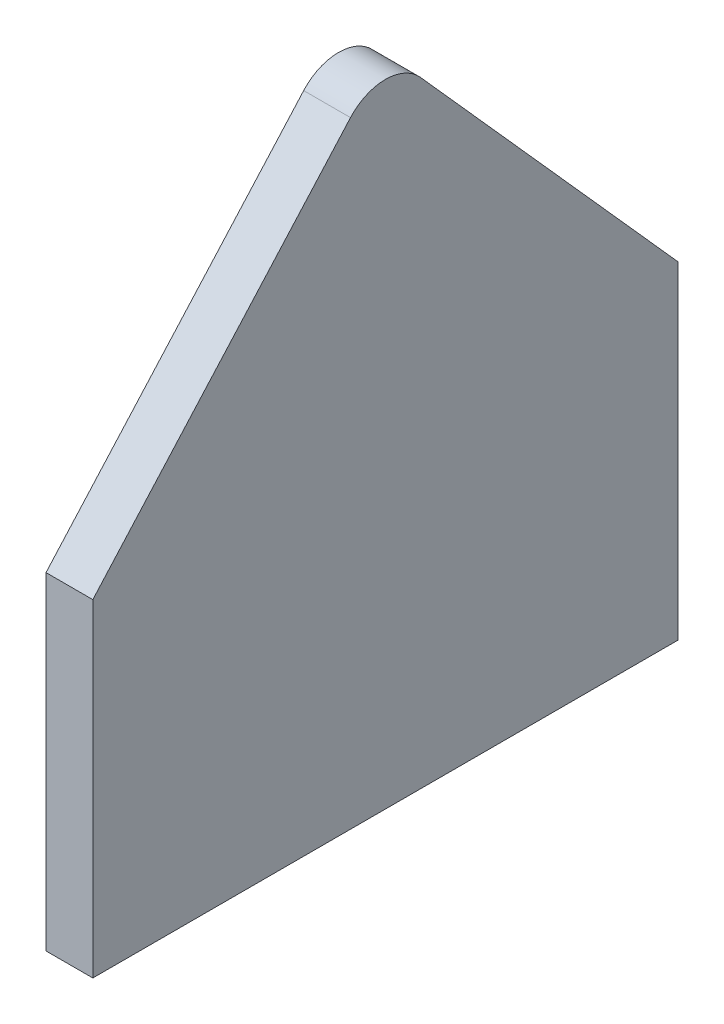
ISO-10303-21;
HEADER;
FILE_DESCRIPTION(('STEP AP214'),'2;1');
FILE_NAME('part.step','',(''),(''),'','','');
FILE_SCHEMA(('AUTOMOTIVE_DESIGN { 1 0 10303 214 1 1 1 1 }'));
ENDSEC;
DATA;
#1=APPLICATION_CONTEXT('core data for automotive mechanical design processes');
#2=APPLICATION_PROTOCOL_DEFINITION('international standard','automotive_design',2000,#1);
#3=PRODUCT_CONTEXT('',#1,'mechanical');
#4=PRODUCT('Part','Part','',(#3));
#5=PRODUCT_RELATED_PRODUCT_CATEGORY('part','',(#4));
#6=PRODUCT_DEFINITION_FORMATION('','',#4);
#7=PRODUCT_DEFINITION_CONTEXT('part definition',#1,'design');
#8=PRODUCT_DEFINITION('design','',#6,#7);
#9=PRODUCT_DEFINITION_SHAPE('','',#8);
#10=(LENGTH_UNIT() NAMED_UNIT(*) SI_UNIT(.MILLI.,.METRE.));
#11=(NAMED_UNIT(*) PLANE_ANGLE_UNIT() SI_UNIT($,.RADIAN.));
#12=(NAMED_UNIT(*) SI_UNIT($,.STERADIAN.) SOLID_ANGLE_UNIT());
#13=UNCERTAINTY_MEASURE_WITH_UNIT(LENGTH_MEASURE(1.E-05),#10,'distance_accuracy_value','');
#14=(GEOMETRIC_REPRESENTATION_CONTEXT(3) GLOBAL_UNCERTAINTY_ASSIGNED_CONTEXT((#13)) GLOBAL_UNIT_ASSIGNED_CONTEXT((#10,
#11,#12)) REPRESENTATION_CONTEXT('',''));
#15=CARTESIAN_POINT('',(0.,0.,0.));
#16=DIRECTION('',(0.,0.,1.));
#17=DIRECTION('',(1.,0.,0.));
#18=AXIS2_PLACEMENT_3D('',#15,#16,#17);
#19=CARTESIAN_POINT('',(2.,0.,-12.5));
#20=DIRECTION('',(0.,0.,1.));
#21=DIRECTION('',(1.,0.,0.));
#22=AXIS2_PLACEMENT_3D('',#19,#20,#21);
#23=PLANE('',#22);
#24=DIRECTION('',(0.,1.,0.));
#25=VECTOR('',#24,1.);
#26=CARTESIAN_POINT('',(0.,0.,-12.5));
#27=LINE('',#26,#25);
#28=CARTESIAN_POINT('',(0.,0.,-12.5));
#29=VERTEX_POINT('',#28);
#30=CARTESIAN_POINT('',(0.,14.,-12.5));
#31=VERTEX_POINT('',#30);
#32=EDGE_CURVE('E102',#29,#31,#27,.T.);
#33=ORIENTED_EDGE('',*,*,#32,.T.);
#34=DIRECTION('',(-1.,0.,0.));
#35=VECTOR('',#34,1.);
#36=CARTESIAN_POINT('',(2.,14.,-12.5));
#37=LINE('',#36,#35);
#38=CARTESIAN_POINT('',(2.,14.,-12.5));
#39=VERTEX_POINT('',#38);
#40=EDGE_CURVE('E85',#39,#31,#37,.T.);
#41=ORIENTED_EDGE('',*,*,#40,.F.);
#42=DIRECTION('',(0.,1.,0.));
#43=VECTOR('',#42,1.);
#44=CARTESIAN_POINT('',(2.,0.,-12.5));
#45=LINE('',#44,#43);
#46=CARTESIAN_POINT('',(2.,0.,-12.5));
#47=VERTEX_POINT('',#46);
#48=EDGE_CURVE('E90',#47,#39,#45,.T.);
#49=ORIENTED_EDGE('',*,*,#48,.F.);
#50=DIRECTION('',(-1.,0.,0.));
#51=VECTOR('',#50,1.);
#52=CARTESIAN_POINT('',(2.,0.,-12.5));
#53=LINE('',#52,#51);
#54=EDGE_CURVE('E115',#47,#29,#53,.T.);
#55=ORIENTED_EDGE('',*,*,#54,.T.);
#56=EDGE_LOOP('',(#33,#41,#49,#55));
#57=FACE_BOUND('',#56,.T.);
#58=ADVANCED_FACE('F32',(#57),#23,.F.);
#59=CARTESIAN_POINT('',(2.,14.,-12.5));
#60=DIRECTION('',(0.,-0.666015769308852,0.745937661625915));
#61=DIRECTION('',(0.,-0.745937661625915,-0.666015769308852));
#62=AXIS2_PLACEMENT_3D('',#59,#60,#61);
#63=PLANE('',#62);
#64=DIRECTION('',(0.,0.745937661625915,0.666015769308852));
#65=VECTOR('',#64,1.);
#66=CARTESIAN_POINT('',(0.,14.,-12.5));
#67=LINE('',#66,#65);
#68=CARTESIAN_POINT('',(0.,26.329099637958,-1.49187532325183));
#69=VERTEX_POINT('',#68);
#70=EDGE_CURVE('E122',#31,#69,#67,.T.);
#71=ORIENTED_EDGE('',*,*,#70,.T.);
#72=DIRECTION('',(-1.,0.,0.));
#73=VECTOR('',#72,1.);
#74=CARTESIAN_POINT('',(2.,26.329099637958,-1.49187532325183));
#75=LINE('',#74,#73);
#76=CARTESIAN_POINT('',(2.,26.329099637958,-1.49187532325183));
#77=VERTEX_POINT('',#76);
#78=EDGE_CURVE('E40',#69,#77,#75,.F.);
#79=ORIENTED_EDGE('',*,*,#78,.T.);
#80=DIRECTION('',(0.,0.745937661625915,0.666015769308852));
#81=VECTOR('',#80,1.);
#82=CARTESIAN_POINT('',(2.,14.,-12.5));
#83=LINE('',#82,#81);
#84=EDGE_CURVE('E81',#39,#77,#83,.T.);
#85=ORIENTED_EDGE('',*,*,#84,.F.);
#86=ORIENTED_EDGE('',*,*,#40,.T.);
#87=EDGE_LOOP('',(#71,#79,#85,#86));
#88=FACE_BOUND('',#87,.T.);
#89=ADVANCED_FACE('F83',(#88),#63,.F.);
#90=CARTESIAN_POINT('',(2.,14.,12.5));
#91=DIRECTION('',(0.,-0.666015769308852,-0.745937661625915));
#92=DIRECTION('',(0.,0.745937661625915,-0.666015769308852));
#93=AXIS2_PLACEMENT_3D('',#90,#91,#92);
#94=PLANE('',#93);
#95=DIRECTION('',(0.,-0.745937661625915,0.666015769308852));
#96=VECTOR('',#95,1.);
#97=CARTESIAN_POINT('',(2.,14.,12.5));
#98=LINE('',#97,#96);
#99=CARTESIAN_POINT('',(2.,26.329099637958,1.49187532325183));
#100=VERTEX_POINT('',#99);
#101=CARTESIAN_POINT('',(2.,14.,12.5));
#102=VERTEX_POINT('',#101);
#103=EDGE_CURVE('E89',#100,#102,#98,.T.);
#104=ORIENTED_EDGE('',*,*,#103,.F.);
#105=DIRECTION('',(-1.,0.,0.));
#106=VECTOR('',#105,1.);
#107=CARTESIAN_POINT('',(2.,26.329099637958,1.49187532325183));
#108=LINE('',#107,#106);
#109=CARTESIAN_POINT('',(0.,26.329099637958,1.49187532325183));
#110=VERTEX_POINT('',#109);
#111=EDGE_CURVE('E103',#100,#110,#108,.T.);
#112=ORIENTED_EDGE('',*,*,#111,.T.);
#113=DIRECTION('',(0.,-0.745937661625915,0.666015769308852));
#114=VECTOR('',#113,1.);
#115=CARTESIAN_POINT('',(0.,14.,12.5));
#116=LINE('',#115,#114);
#117=CARTESIAN_POINT('',(0.,14.,12.5));
#118=VERTEX_POINT('',#117);
#119=EDGE_CURVE('E120',#110,#118,#116,.T.);
#120=ORIENTED_EDGE('',*,*,#119,.T.);
#121=DIRECTION('',(-1.,0.,0.));
#122=VECTOR('',#121,1.);
#123=CARTESIAN_POINT('',(2.,14.,12.5));
#124=LINE('',#123,#122);
#125=EDGE_CURVE('E104',#102,#118,#124,.T.);
#126=ORIENTED_EDGE('',*,*,#125,.F.);
#127=EDGE_LOOP('',(#104,#112,#120,#126));
#128=FACE_BOUND('',#127,.T.);
#129=ADVANCED_FACE('F134',(#128),#94,.F.);
#130=CARTESIAN_POINT('',(2.,0.,12.5));
#131=DIRECTION('',(0.,0.,-1.));
#132=DIRECTION('',(-1.,0.,0.));
#133=AXIS2_PLACEMENT_3D('',#130,#131,#132);
#134=PLANE('',#133);
#135=DIRECTION('',(0.,-1.,0.));
#136=VECTOR('',#135,1.);
#137=CARTESIAN_POINT('',(0.,0.,12.5));
#138=LINE('',#137,#136);
#139=CARTESIAN_POINT('',(0.,0.,12.5));
#140=VERTEX_POINT('',#139);
#141=EDGE_CURVE('E118',#118,#140,#138,.T.);
#142=ORIENTED_EDGE('',*,*,#141,.T.);
#143=DIRECTION('',(-1.,0.,0.));
#144=VECTOR('',#143,1.);
#145=CARTESIAN_POINT('',(2.,0.,12.5));
#146=LINE('',#145,#144);
#147=CARTESIAN_POINT('',(2.,0.,12.5));
#148=VERTEX_POINT('',#147);
#149=EDGE_CURVE('E109',#148,#140,#146,.T.);
#150=ORIENTED_EDGE('',*,*,#149,.F.);
#151=DIRECTION('',(0.,-1.,0.));
#152=VECTOR('',#151,1.);
#153=CARTESIAN_POINT('',(2.,0.,12.5));
#154=LINE('',#153,#152);
#155=EDGE_CURVE('E126',#102,#148,#154,.T.);
#156=ORIENTED_EDGE('',*,*,#155,.F.);
#157=ORIENTED_EDGE('',*,*,#125,.T.);
#158=EDGE_LOOP('',(#142,#150,#156,#157));
#159=FACE_BOUND('',#158,.T.);
#160=ADVANCED_FACE('F137',(#159),#134,.F.);
#161=CARTESIAN_POINT('',(2.,0.,-12.5));
#162=DIRECTION('',(0.,1.,0.));
#163=DIRECTION('',(0.,0.,1.));
#164=AXIS2_PLACEMENT_3D('',#161,#162,#163);
#165=PLANE('',#164);
#166=DIRECTION('',(0.,0.,-1.));
#167=VECTOR('',#166,1.);
#168=CARTESIAN_POINT('',(0.,0.,-12.5));
#169=LINE('',#168,#167);
#170=EDGE_CURVE('E99',#140,#29,#169,.T.);
#171=ORIENTED_EDGE('',*,*,#170,.T.);
#172=ORIENTED_EDGE('',*,*,#54,.F.);
#173=DIRECTION('',(0.,0.,-1.));
#174=VECTOR('',#173,1.);
#175=CARTESIAN_POINT('',(2.,0.,-12.5));
#176=LINE('',#175,#174);
#177=EDGE_CURVE('E95',#148,#47,#176,.T.);
#178=ORIENTED_EDGE('',*,*,#177,.F.);
#179=ORIENTED_EDGE('',*,*,#149,.T.);
#180=EDGE_LOOP('',(#171,#172,#178,#179));
#181=FACE_BOUND('',#180,.T.);
#182=ADVANCED_FACE('F140',(#181),#165,.F.);
#183=CARTESIAN_POINT('',(2.,0.,0.));
#184=DIRECTION('',(1.,0.,0.));
#185=DIRECTION('',(0.,0.,-1.));
#186=AXIS2_PLACEMENT_3D('',#183,#184,#185);
#187=PLANE('',#186);
#188=ORIENTED_EDGE('',*,*,#84,.T.);
#189=CARTESIAN_POINT('',(2.,24.9970680993402,0.));
#190=DIRECTION('',(1.,0.,0.));
#191=DIRECTION('',(0.,0.,-1.));
#192=AXIS2_PLACEMENT_3D('',#189,#190,#191);
#193=CIRCLE('',#192,2.);
#194=EDGE_CURVE('E11',#77,#100,#193,.T.);
#195=ORIENTED_EDGE('',*,*,#194,.T.);
#196=ORIENTED_EDGE('',*,*,#103,.T.);
#197=ORIENTED_EDGE('',*,*,#155,.T.);
#198=ORIENTED_EDGE('',*,*,#177,.T.);
#199=ORIENTED_EDGE('',*,*,#48,.T.);
#200=EDGE_LOOP('',(#188,#195,#196,#197,#198,#199));
#201=FACE_BOUND('',#200,.T.);
#202=ADVANCED_FACE('F93',(#201),#187,.T.);
#203=CARTESIAN_POINT('',(0.,0.,0.));
#204=DIRECTION('',(1.,0.,0.));
#205=DIRECTION('',(0.,0.,-1.));
#206=AXIS2_PLACEMENT_3D('',#203,#204,#205);
#207=PLANE('',#206);
#208=ORIENTED_EDGE('',*,*,#119,.F.);
#209=CARTESIAN_POINT('',(0.,24.9970680993402,0.));
#210=DIRECTION('',(1.,0.,0.));
#211=DIRECTION('',(0.,0.,-1.));
#212=AXIS2_PLACEMENT_3D('',#209,#210,#211);
#213=CIRCLE('',#212,2.);
#214=EDGE_CURVE('E54',#110,#69,#213,.F.);
#215=ORIENTED_EDGE('',*,*,#214,.T.);
#216=ORIENTED_EDGE('',*,*,#70,.F.);
#217=ORIENTED_EDGE('',*,*,#32,.F.);
#218=ORIENTED_EDGE('',*,*,#170,.F.);
#219=ORIENTED_EDGE('',*,*,#141,.F.);
#220=EDGE_LOOP('',(#208,#215,#216,#217,#218,#219));
#221=FACE_BOUND('',#220,.T.);
#222=ADVANCED_FACE('F141',(#221),#207,.F.);
#223=CARTESIAN_POINT('',(2.,24.9970680993402,0.));
#224=DIRECTION('',(-1.,0.,0.));
#225=DIRECTION('',(0.,0.,1.));
#226=AXIS2_PLACEMENT_3D('',#223,#224,#225);
#227=CYLINDRICAL_SURFACE('',#226,2.);
#228=ORIENTED_EDGE('',*,*,#194,.F.);
#229=ORIENTED_EDGE('',*,*,#78,.F.);
#230=ORIENTED_EDGE('',*,*,#214,.F.);
#231=ORIENTED_EDGE('',*,*,#111,.F.);
#232=EDGE_LOOP('',(#228,#229,#230,#231));
#233=FACE_BOUND('',#232,.T.);
#234=ADVANCED_FACE('F34',(#233),#227,.T.);
#235=CLOSED_SHELL('',(#58,#89,#129,#160,#182,#202,#222,#234));
#236=MANIFOLD_SOLID_BREP('B2',#235);
#237=ADVANCED_BREP_SHAPE_REPRESENTATION('',(#18,#236),#14);
#238=SHAPE_DEFINITION_REPRESENTATION(#9,#237);
ENDSEC;
END-ISO-10303-21;
